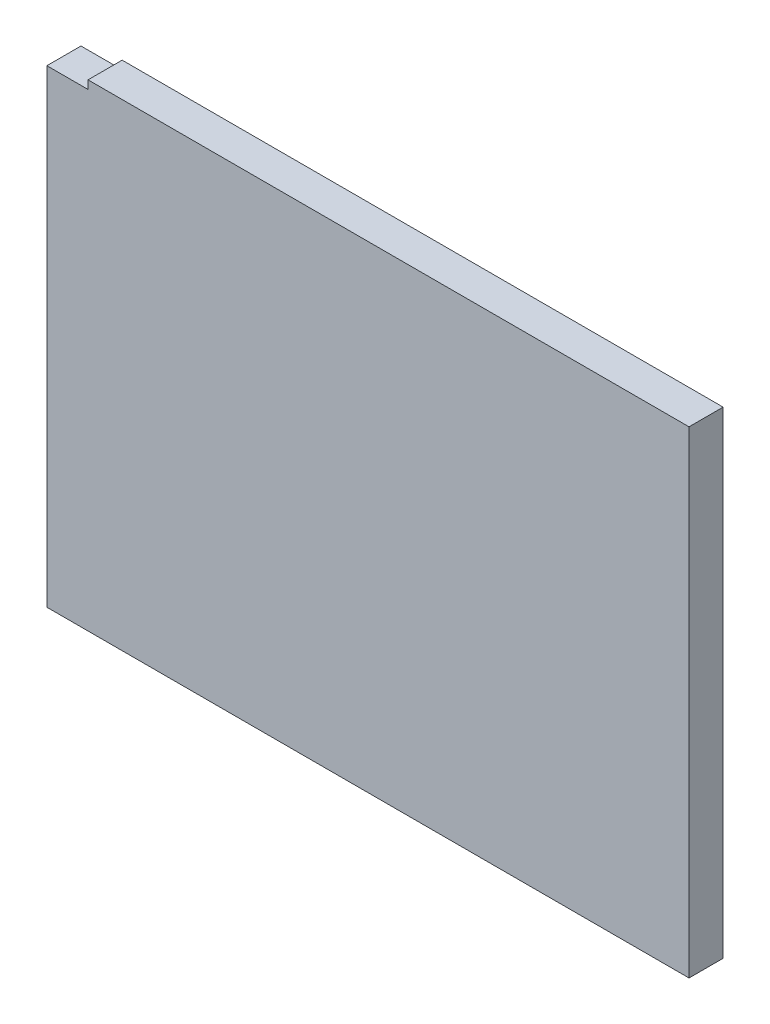
ISO-10303-21;
HEADER;
FILE_DESCRIPTION(('STEP AP214'),'2;1');
FILE_NAME('part.step','',(''),(''),'','','');
FILE_SCHEMA(('AUTOMOTIVE_DESIGN { 1 0 10303 214 1 1 1 1 }'));
ENDSEC;
DATA;
#1=APPLICATION_CONTEXT('core data for automotive mechanical design processes');
#2=APPLICATION_PROTOCOL_DEFINITION('international standard','automotive_design',2000,#1);
#3=PRODUCT_CONTEXT('',#1,'mechanical');
#4=PRODUCT('Part','Part','',(#3));
#5=PRODUCT_RELATED_PRODUCT_CATEGORY('part','',(#4));
#6=PRODUCT_DEFINITION_FORMATION('','',#4);
#7=PRODUCT_DEFINITION_CONTEXT('part definition',#1,'design');
#8=PRODUCT_DEFINITION('design','',#6,#7);
#9=PRODUCT_DEFINITION_SHAPE('','',#8);
#10=(LENGTH_UNIT() NAMED_UNIT(*) SI_UNIT(.MILLI.,.METRE.));
#11=(NAMED_UNIT(*) PLANE_ANGLE_UNIT() SI_UNIT($,.RADIAN.));
#12=(NAMED_UNIT(*) SI_UNIT($,.STERADIAN.) SOLID_ANGLE_UNIT());
#13=UNCERTAINTY_MEASURE_WITH_UNIT(LENGTH_MEASURE(1.E-05),#10,'distance_accuracy_value','');
#14=(GEOMETRIC_REPRESENTATION_CONTEXT(3) GLOBAL_UNCERTAINTY_ASSIGNED_CONTEXT((#13)) GLOBAL_UNIT_ASSIGNED_CONTEXT((#10,
#11,#12)) REPRESENTATION_CONTEXT('',''));
#15=CARTESIAN_POINT('',(0.,0.,0.));
#16=DIRECTION('',(0.,0.,1.));
#17=DIRECTION('',(1.,0.,0.));
#18=AXIS2_PLACEMENT_3D('',#15,#16,#17);
#19=CARTESIAN_POINT('',(-4980.94,1379.22,-11.43));
#20=DIRECTION('',(0.,1.,0.));
#21=DIRECTION('',(0.,0.,1.));
#22=AXIS2_PLACEMENT_3D('',#19,#20,#21);
#23=PLANE('',#22);
#24=DIRECTION('',(0.,0.,-1.));
#25=VECTOR('',#24,1.);
#26=CARTESIAN_POINT('',(-4967.14145,1379.22,14.0785801167062));
#27=LINE('',#26,#25);
#28=CARTESIAN_POINT('',(-4967.14145,1379.22,0.));
#29=VERTEX_POINT('',#28);
#30=CARTESIAN_POINT('',(-4967.14145,1379.22,-11.43));
#31=VERTEX_POINT('',#30);
#32=EDGE_CURVE('E91',#29,#31,#27,.T.);
#33=ORIENTED_EDGE('',*,*,#32,.F.);
#34=DIRECTION('',(-1.,0.,0.));
#35=VECTOR('',#34,1.);
#36=CARTESIAN_POINT('',(-4980.94,1379.22,0.));
#37=LINE('',#36,#35);
#38=CARTESIAN_POINT('',(-4765.675,1379.22,0.));
#39=VERTEX_POINT('',#38);
#40=EDGE_CURVE('E119',#39,#29,#37,.T.);
#41=ORIENTED_EDGE('',*,*,#40,.F.);
#42=DIRECTION('',(0.,0.,1.));
#43=VECTOR('',#42,1.);
#44=CARTESIAN_POINT('',(-4765.675,1379.22,-11.43));
#45=LINE('',#44,#43);
#46=CARTESIAN_POINT('',(-4765.675,1379.22,-11.43));
#47=VERTEX_POINT('',#46);
#48=EDGE_CURVE('E11',#47,#39,#45,.T.);
#49=ORIENTED_EDGE('',*,*,#48,.F.);
#50=DIRECTION('',(-1.,0.,0.));
#51=VECTOR('',#50,1.);
#52=CARTESIAN_POINT('',(-4980.94,1379.22,-11.43));
#53=LINE('',#52,#51);
#54=EDGE_CURVE('E104',#47,#31,#53,.T.);
#55=ORIENTED_EDGE('',*,*,#54,.T.);
#56=EDGE_LOOP('',(#33,#41,#49,#55));
#57=FACE_BOUND('',#56,.T.);
#58=ADVANCED_FACE('F31',(#57),#23,.T.);
#59=CARTESIAN_POINT('',(-4765.675,1379.22,-11.43));
#60=DIRECTION('',(1.,0.,0.));
#61=DIRECTION('',(0.,0.,-1.));
#62=AXIS2_PLACEMENT_3D('',#59,#60,#61);
#63=PLANE('',#62);
#64=DIRECTION('',(0.,1.,0.));
#65=VECTOR('',#64,1.);
#66=CARTESIAN_POINT('',(-4765.675,1379.22,0.));
#67=LINE('',#66,#65);
#68=CARTESIAN_POINT('',(-4765.675,1219.2,0.));
#69=VERTEX_POINT('',#68);
#70=EDGE_CURVE('E106',#69,#39,#67,.T.);
#71=ORIENTED_EDGE('',*,*,#70,.F.);
#72=DIRECTION('',(0.,0.,1.));
#73=VECTOR('',#72,1.);
#74=CARTESIAN_POINT('',(-4765.675,1219.2,-11.43));
#75=LINE('',#74,#73);
#76=CARTESIAN_POINT('',(-4765.675,1219.2,-11.43));
#77=VERTEX_POINT('',#76);
#78=EDGE_CURVE('E39',#77,#69,#75,.T.);
#79=ORIENTED_EDGE('',*,*,#78,.F.);
#80=DIRECTION('',(0.,1.,0.));
#81=VECTOR('',#80,1.);
#82=CARTESIAN_POINT('',(-4765.675,1379.22,-11.43));
#83=LINE('',#82,#81);
#84=EDGE_CURVE('E117',#77,#47,#83,.T.);
#85=ORIENTED_EDGE('',*,*,#84,.T.);
#86=ORIENTED_EDGE('',*,*,#48,.T.);
#87=EDGE_LOOP('',(#71,#79,#85,#86));
#88=FACE_BOUND('',#87,.T.);
#89=ADVANCED_FACE('F134',(#88),#63,.T.);
#90=CARTESIAN_POINT('',(-4765.675,1219.2,-11.43));
#91=DIRECTION('',(0.,-1.,0.));
#92=DIRECTION('',(1.,0.,0.));
#93=AXIS2_PLACEMENT_3D('',#90,#91,#92);
#94=PLANE('',#93);
#95=DIRECTION('',(1.,0.,0.));
#96=VECTOR('',#95,1.);
#97=CARTESIAN_POINT('',(-4765.675,1219.2,0.));
#98=LINE('',#97,#96);
#99=CARTESIAN_POINT('',(-4980.94,1219.2,0.));
#100=VERTEX_POINT('',#99);
#101=EDGE_CURVE('E111',#100,#69,#98,.T.);
#102=ORIENTED_EDGE('',*,*,#101,.F.);
#103=DIRECTION('',(0.,0.,1.));
#104=VECTOR('',#103,1.);
#105=CARTESIAN_POINT('',(-4980.94,1219.2,-11.43));
#106=LINE('',#105,#104);
#107=CARTESIAN_POINT('',(-4980.94,1219.2,-11.43));
#108=VERTEX_POINT('',#107);
#109=EDGE_CURVE('E34',#108,#100,#106,.T.);
#110=ORIENTED_EDGE('',*,*,#109,.F.);
#111=DIRECTION('',(1.,0.,0.));
#112=VECTOR('',#111,1.);
#113=CARTESIAN_POINT('',(-4765.675,1219.2,-11.43));
#114=LINE('',#113,#112);
#115=EDGE_CURVE('E108',#108,#77,#114,.T.);
#116=ORIENTED_EDGE('',*,*,#115,.T.);
#117=ORIENTED_EDGE('',*,*,#78,.T.);
#118=EDGE_LOOP('',(#102,#110,#116,#117));
#119=FACE_BOUND('',#118,.T.);
#120=ADVANCED_FACE('F130',(#119),#94,.T.);
#121=CARTESIAN_POINT('',(-4980.94,1219.2,-11.43));
#122=DIRECTION('',(-1.,0.,0.));
#123=DIRECTION('',(0.,0.,1.));
#124=AXIS2_PLACEMENT_3D('',#121,#122,#123);
#125=PLANE('',#124);
#126=DIRECTION('',(0.,0.,-1.));
#127=VECTOR('',#126,1.);
#128=CARTESIAN_POINT('',(-4980.94,1376.426,14.0785801167062));
#129=LINE('',#128,#127);
#130=CARTESIAN_POINT('',(-4980.94,1376.426,0.));
#131=VERTEX_POINT('',#130);
#132=CARTESIAN_POINT('',(-4980.94,1376.426,-11.43));
#133=VERTEX_POINT('',#132);
#134=EDGE_CURVE('E159',#131,#133,#129,.T.);
#135=ORIENTED_EDGE('',*,*,#134,.T.);
#136=DIRECTION('',(0.,-1.,0.));
#137=VECTOR('',#136,1.);
#138=CARTESIAN_POINT('',(-4980.94,1219.2,-11.43));
#139=LINE('',#138,#137);
#140=EDGE_CURVE('E76',#133,#108,#139,.T.);
#141=ORIENTED_EDGE('',*,*,#140,.T.);
#142=ORIENTED_EDGE('',*,*,#109,.T.);
#143=DIRECTION('',(0.,-1.,0.));
#144=VECTOR('',#143,1.);
#145=CARTESIAN_POINT('',(-4980.94,1219.2,0.));
#146=LINE('',#145,#144);
#147=EDGE_CURVE('E121',#131,#100,#146,.T.);
#148=ORIENTED_EDGE('',*,*,#147,.F.);
#149=EDGE_LOOP('',(#135,#141,#142,#148));
#150=FACE_BOUND('',#149,.T.);
#151=ADVANCED_FACE('F128',(#150),#125,.T.);
#152=CARTESIAN_POINT('',(-4765.675,1379.22,-11.43));
#153=DIRECTION('',(0.,0.,-1.));
#154=DIRECTION('',(-1.,0.,0.));
#155=AXIS2_PLACEMENT_3D('',#152,#153,#154);
#156=PLANE('',#155);
#157=DIRECTION('',(-1.,0.,0.));
#158=VECTOR('',#157,1.);
#159=CARTESIAN_POINT('',(-4980.94,1376.426,-11.43));
#160=LINE('',#159,#158);
#161=CARTESIAN_POINT('',(-4967.14145,1376.426,-11.43));
#162=VERTEX_POINT('',#161);
#163=EDGE_CURVE('E99',#162,#133,#160,.T.);
#164=ORIENTED_EDGE('',*,*,#163,.F.);
#165=DIRECTION('',(0.,-1.,0.));
#166=VECTOR('',#165,1.);
#167=CARTESIAN_POINT('',(-4967.14145,1376.426,-11.43));
#168=LINE('',#167,#166);
#169=EDGE_CURVE('E94',#31,#162,#168,.T.);
#170=ORIENTED_EDGE('',*,*,#169,.F.);
#171=ORIENTED_EDGE('',*,*,#54,.F.);
#172=ORIENTED_EDGE('',*,*,#84,.F.);
#173=ORIENTED_EDGE('',*,*,#115,.F.);
#174=ORIENTED_EDGE('',*,*,#140,.F.);
#175=EDGE_LOOP('',(#164,#170,#171,#172,#173,#174));
#176=FACE_BOUND('',#175,.T.);
#177=ADVANCED_FACE('F102',(#176),#156,.T.);
#178=CARTESIAN_POINT('',(-4765.675,1379.22,0.));
#179=DIRECTION('',(0.,0.,-1.));
#180=DIRECTION('',(-1.,0.,0.));
#181=AXIS2_PLACEMENT_3D('',#178,#179,#180);
#182=PLANE('',#181);
#183=DIRECTION('',(0.,1.,0.));
#184=VECTOR('',#183,1.);
#185=CARTESIAN_POINT('',(-4967.14145,1376.426,0.));
#186=LINE('',#185,#184);
#187=CARTESIAN_POINT('',(-4967.14145,1376.426,0.));
#188=VERTEX_POINT('',#187);
#189=EDGE_CURVE('E97',#188,#29,#186,.T.);
#190=ORIENTED_EDGE('',*,*,#189,.F.);
#191=DIRECTION('',(1.,0.,0.));
#192=VECTOR('',#191,1.);
#193=CARTESIAN_POINT('',(-4980.94,1376.426,0.));
#194=LINE('',#193,#192);
#195=EDGE_CURVE('E122',#131,#188,#194,.T.);
#196=ORIENTED_EDGE('',*,*,#195,.F.);
#197=ORIENTED_EDGE('',*,*,#147,.T.);
#198=ORIENTED_EDGE('',*,*,#101,.T.);
#199=ORIENTED_EDGE('',*,*,#70,.T.);
#200=ORIENTED_EDGE('',*,*,#40,.T.);
#201=EDGE_LOOP('',(#190,#196,#197,#198,#199,#200));
#202=FACE_BOUND('',#201,.T.);
#203=ADVANCED_FACE('F132',(#202),#182,.F.);
#204=CARTESIAN_POINT('',(-4980.94,1376.426,14.0785801167062));
#205=DIRECTION('',(0.,-1.,0.));
#206=DIRECTION('',(0.,0.,-1.));
#207=AXIS2_PLACEMENT_3D('',#204,#205,#206);
#208=PLANE('',#207);
#209=ORIENTED_EDGE('',*,*,#195,.T.);
#210=DIRECTION('',(0.,0.,-1.));
#211=VECTOR('',#210,1.);
#212=CARTESIAN_POINT('',(-4967.14145,1376.426,14.0785801167062));
#213=LINE('',#212,#211);
#214=EDGE_CURVE('E47',#188,#162,#213,.T.);
#215=ORIENTED_EDGE('',*,*,#214,.T.);
#216=ORIENTED_EDGE('',*,*,#163,.T.);
#217=ORIENTED_EDGE('',*,*,#134,.F.);
#218=EDGE_LOOP('',(#209,#215,#216,#217));
#219=FACE_BOUND('',#218,.T.);
#220=ADVANCED_FACE('F151',(#219),#208,.F.);
#221=CARTESIAN_POINT('',(-4967.14145,1376.426,14.0785801167062));
#222=DIRECTION('',(1.,0.,0.));
#223=DIRECTION('',(0.,0.,-1.));
#224=AXIS2_PLACEMENT_3D('',#221,#222,#223);
#225=PLANE('',#224);
#226=ORIENTED_EDGE('',*,*,#189,.T.);
#227=ORIENTED_EDGE('',*,*,#32,.T.);
#228=ORIENTED_EDGE('',*,*,#169,.T.);
#229=ORIENTED_EDGE('',*,*,#214,.F.);
#230=EDGE_LOOP('',(#226,#227,#228,#229));
#231=FACE_BOUND('',#230,.T.);
#232=ADVANCED_FACE('F93',(#231),#225,.F.);
#233=CLOSED_SHELL('',(#58,#89,#120,#151,#177,#203,#220,#232));
#234=MANIFOLD_SOLID_BREP('B2',#233);
#235=ADVANCED_BREP_SHAPE_REPRESENTATION('',(#18,#234),#14);
#236=SHAPE_DEFINITION_REPRESENTATION(#9,#235);
ENDSEC;
END-ISO-10303-21;
